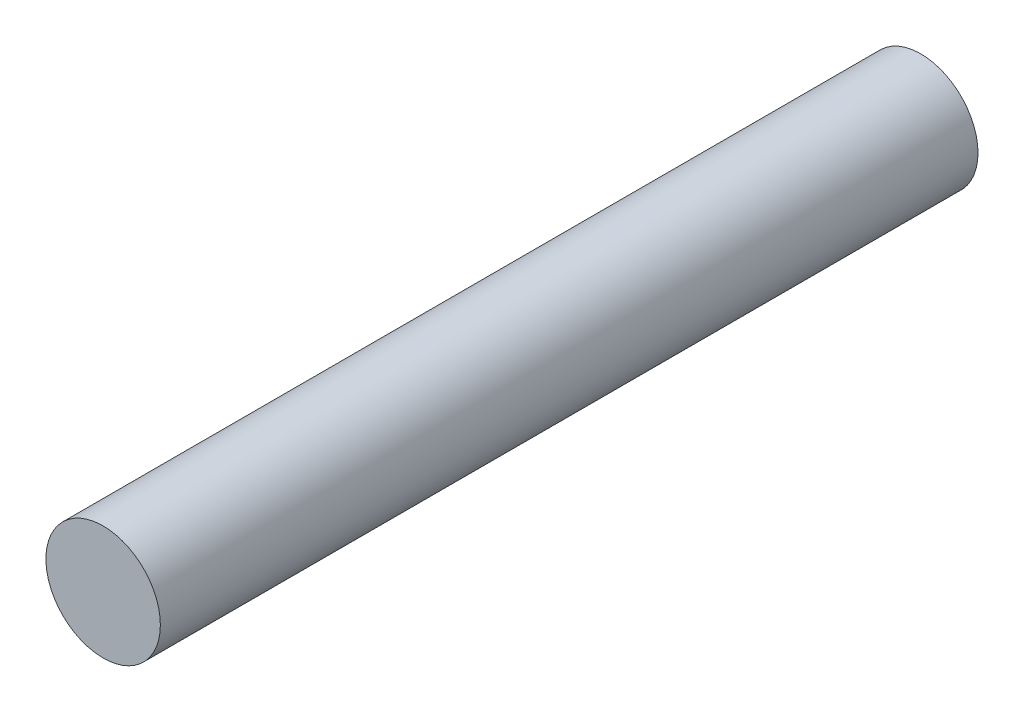
ISO-10303-21;
HEADER;
FILE_DESCRIPTION(('STEP AP214'),'2;1');
FILE_NAME('part.step','',(''),(''),'','','');
FILE_SCHEMA(('AUTOMOTIVE_DESIGN { 1 0 10303 214 1 1 1 1 }'));
ENDSEC;
DATA;
#1=APPLICATION_CONTEXT('core data for automotive mechanical design processes');
#2=APPLICATION_PROTOCOL_DEFINITION('international standard','automotive_design',2000,#1);
#3=PRODUCT_CONTEXT('',#1,'mechanical');
#4=PRODUCT('Part','Part','',(#3));
#5=PRODUCT_RELATED_PRODUCT_CATEGORY('part','',(#4));
#6=PRODUCT_DEFINITION_FORMATION('','',#4);
#7=PRODUCT_DEFINITION_CONTEXT('part definition',#1,'design');
#8=PRODUCT_DEFINITION('design','',#6,#7);
#9=PRODUCT_DEFINITION_SHAPE('','',#8);
#10=(LENGTH_UNIT() NAMED_UNIT(*) SI_UNIT(.MILLI.,.METRE.));
#11=(NAMED_UNIT(*) PLANE_ANGLE_UNIT() SI_UNIT($,.RADIAN.));
#12=(NAMED_UNIT(*) SI_UNIT($,.STERADIAN.) SOLID_ANGLE_UNIT());
#13=UNCERTAINTY_MEASURE_WITH_UNIT(LENGTH_MEASURE(1.E-05),#10,'distance_accuracy_value','');
#14=(GEOMETRIC_REPRESENTATION_CONTEXT(3) GLOBAL_UNCERTAINTY_ASSIGNED_CONTEXT((#13)) GLOBAL_UNIT_ASSIGNED_CONTEXT((#10,
#11,#12)) REPRESENTATION_CONTEXT('',''));
#15=CARTESIAN_POINT('',(0.,0.,0.));
#16=DIRECTION('',(0.,0.,1.));
#17=DIRECTION('',(1.,0.,0.));
#18=AXIS2_PLACEMENT_3D('',#15,#16,#17);
#19=CARTESIAN_POINT('',(0.,0.,50.));
#20=DIRECTION('',(0.,0.,-1.));
#21=DIRECTION('',(-1.,0.,0.));
#22=AXIS2_PLACEMENT_3D('',#19,#20,#21);
#23=CYLINDRICAL_SURFACE('',#22,3.5);
#24=CARTESIAN_POINT('',(0.,0.,50.));
#25=DIRECTION('',(0.,0.,1.));
#26=DIRECTION('',(1.,0.,0.));
#27=AXIS2_PLACEMENT_3D('',#24,#25,#26);
#28=CIRCLE('',#27,3.5);
#29=CARTESIAN_POINT('',(3.5,0.,50.));
#30=VERTEX_POINT('',#29);
#31=EDGE_CURVE('E10',#30,#30,#28,.T.);
#32=ORIENTED_EDGE('',*,*,#31,.F.);
#33=EDGE_LOOP('',(#32));
#34=FACE_BOUND('',#33,.T.);
#35=CARTESIAN_POINT('',(0.,0.,0.));
#36=DIRECTION('',(0.,0.,1.));
#37=DIRECTION('',(1.,0.,0.));
#38=AXIS2_PLACEMENT_3D('',#35,#36,#37);
#39=CIRCLE('',#38,3.5);
#40=CARTESIAN_POINT('',(3.5,0.,0.));
#41=VERTEX_POINT('',#40);
#42=EDGE_CURVE('E34',#41,#41,#39,.T.);
#43=ORIENTED_EDGE('',*,*,#42,.T.);
#44=EDGE_LOOP('',(#43));
#45=FACE_BOUND('',#44,.T.);
#46=ADVANCED_FACE('F31',(#34,#45),#23,.T.);
#47=CARTESIAN_POINT('',(0.,0.,50.));
#48=DIRECTION('',(0.,0.,1.));
#49=DIRECTION('',(1.,0.,0.));
#50=AXIS2_PLACEMENT_3D('',#47,#48,#49);
#51=PLANE('',#50);
#52=ORIENTED_EDGE('',*,*,#31,.T.);
#53=EDGE_LOOP('',(#52));
#54=FACE_BOUND('',#53,.T.);
#55=ADVANCED_FACE('F46',(#54),#51,.T.);
#56=CARTESIAN_POINT('',(0.,0.,0.));
#57=DIRECTION('',(0.,0.,1.));
#58=DIRECTION('',(1.,0.,0.));
#59=AXIS2_PLACEMENT_3D('',#56,#57,#58);
#60=PLANE('',#59);
#61=ORIENTED_EDGE('',*,*,#42,.F.);
#62=EDGE_LOOP('',(#61));
#63=FACE_BOUND('',#62,.T.);
#64=ADVANCED_FACE('F44',(#63),#60,.F.);
#65=CLOSED_SHELL('',(#46,#55,#64));
#66=MANIFOLD_SOLID_BREP('B2',#65);
#67=ADVANCED_BREP_SHAPE_REPRESENTATION('',(#18,#66),#14);
#68=SHAPE_DEFINITION_REPRESENTATION(#9,#67);
ENDSEC;
END-ISO-10303-21;
